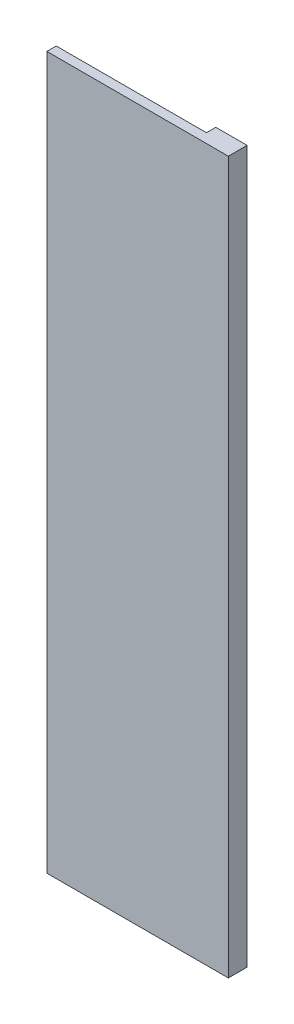
ISO-10303-21;
HEADER;
FILE_DESCRIPTION(('STEP AP214'),'2;1');
FILE_NAME('part.step','',(''),(''),'','','');
FILE_SCHEMA(('AUTOMOTIVE_DESIGN { 1 0 10303 214 1 1 1 1 }'));
ENDSEC;
DATA;
#1=APPLICATION_CONTEXT('core data for automotive mechanical design processes');
#2=APPLICATION_PROTOCOL_DEFINITION('international standard','automotive_design',2000,#1);
#3=PRODUCT_CONTEXT('',#1,'mechanical');
#4=PRODUCT('Part','Part','',(#3));
#5=PRODUCT_RELATED_PRODUCT_CATEGORY('part','',(#4));
#6=PRODUCT_DEFINITION_FORMATION('','',#4);
#7=PRODUCT_DEFINITION_CONTEXT('part definition',#1,'design');
#8=PRODUCT_DEFINITION('design','',#6,#7);
#9=PRODUCT_DEFINITION_SHAPE('','',#8);
#10=(LENGTH_UNIT() NAMED_UNIT(*) SI_UNIT(.MILLI.,.METRE.));
#11=(NAMED_UNIT(*) PLANE_ANGLE_UNIT() SI_UNIT($,.RADIAN.));
#12=(NAMED_UNIT(*) SI_UNIT($,.STERADIAN.) SOLID_ANGLE_UNIT());
#13=UNCERTAINTY_MEASURE_WITH_UNIT(LENGTH_MEASURE(1.E-05),#10,'distance_accuracy_value','');
#14=(GEOMETRIC_REPRESENTATION_CONTEXT(3) GLOBAL_UNCERTAINTY_ASSIGNED_CONTEXT((#13)) GLOBAL_UNIT_ASSIGNED_CONTEXT((#10,
#11,#12)) REPRESENTATION_CONTEXT('',''));
#15=CARTESIAN_POINT('',(0.,0.,0.));
#16=DIRECTION('',(0.,0.,1.));
#17=DIRECTION('',(1.,0.,0.));
#18=AXIS2_PLACEMENT_3D('',#15,#16,#17);
#19=CARTESIAN_POINT('',(48.,0.,-6.));
#20=DIRECTION('',(-1.,0.,0.));
#21=DIRECTION('',(0.,0.,1.));
#22=AXIS2_PLACEMENT_3D('',#19,#20,#21);
#23=PLANE('',#22);
#24=DIRECTION('',(0.,0.,-1.));
#25=VECTOR('',#24,1.);
#26=CARTESIAN_POINT('',(48.,10.,28.2842712474619));
#27=LINE('',#26,#25);
#28=CARTESIAN_POINT('',(48.,10.,0.));
#29=VERTEX_POINT('',#28);
#30=CARTESIAN_POINT('',(48.,10.,-6.));
#31=VERTEX_POINT('',#30);
#32=EDGE_CURVE('E49',#29,#31,#27,.T.);
#33=ORIENTED_EDGE('',*,*,#32,.F.);
#34=DIRECTION('',(0.,-1.,0.));
#35=VECTOR('',#34,1.);
#36=CARTESIAN_POINT('',(48.,0.,0.));
#37=LINE('',#36,#35);
#38=CARTESIAN_POINT('',(48.,435.,0.));
#39=VERTEX_POINT('',#38);
#40=EDGE_CURVE('E123',#39,#29,#37,.T.);
#41=ORIENTED_EDGE('',*,*,#40,.F.);
#42=DIRECTION('',(0.,0.,1.));
#43=VECTOR('',#42,1.);
#44=CARTESIAN_POINT('',(48.,435.,-6.));
#45=LINE('',#44,#43);
#46=CARTESIAN_POINT('',(48.,435.,-6.));
#47=VERTEX_POINT('',#46);
#48=EDGE_CURVE('E11',#47,#39,#45,.T.);
#49=ORIENTED_EDGE('',*,*,#48,.F.);
#50=DIRECTION('',(0.,-1.,0.));
#51=VECTOR('',#50,1.);
#52=CARTESIAN_POINT('',(48.,0.,-6.));
#53=LINE('',#52,#51);
#54=EDGE_CURVE('E127',#47,#31,#53,.T.);
#55=ORIENTED_EDGE('',*,*,#54,.T.);
#56=EDGE_LOOP('',(#33,#41,#49,#55));
#57=FACE_BOUND('',#56,.T.);
#58=ADVANCED_FACE('F33',(#57),#23,.T.);
#59=CARTESIAN_POINT('',(0.,435.,-6.));
#60=DIRECTION('',(0.,-1.,0.));
#61=DIRECTION('',(0.,0.,-1.));
#62=AXIS2_PLACEMENT_3D('',#59,#60,#61);
#63=PLANE('',#62);
#64=ORIENTED_EDGE('',*,*,#48,.T.);
#65=DIRECTION('',(-1.,0.,0.));
#66=VECTOR('',#65,1.);
#67=CARTESIAN_POINT('',(68.0000000000001,435.,0.));
#68=LINE('',#67,#66);
#69=CARTESIAN_POINT('',(-48.,435.,0.));
#70=VERTEX_POINT('',#69);
#71=EDGE_CURVE('E143',#39,#70,#68,.T.);
#72=ORIENTED_EDGE('',*,*,#71,.T.);
#73=DIRECTION('',(0.,0.,-1.));
#74=VECTOR('',#73,1.);
#75=CARTESIAN_POINT('',(-48.,435.,6.));
#76=LINE('',#75,#74);
#77=CARTESIAN_POINT('',(-48.,435.,6.));
#78=VERTEX_POINT('',#77);
#79=EDGE_CURVE('E126',#78,#70,#76,.T.);
#80=ORIENTED_EDGE('',*,*,#79,.F.);
#81=DIRECTION('',(-1.,0.,0.));
#82=VECTOR('',#81,1.);
#83=CARTESIAN_POINT('',(68.0000000000001,435.,6.));
#84=LINE('',#83,#82);
#85=CARTESIAN_POINT('',(68.0000000000001,435.,6.));
#86=VERTEX_POINT('',#85);
#87=EDGE_CURVE('E145',#86,#78,#84,.T.);
#88=ORIENTED_EDGE('',*,*,#87,.F.);
#89=DIRECTION('',(0.,0.,1.));
#90=VECTOR('',#89,1.);
#91=CARTESIAN_POINT('',(67.9999999999999,435.,-6.));
#92=LINE('',#91,#90);
#93=CARTESIAN_POINT('',(67.9999999999999,435.,-6.));
#94=VERTEX_POINT('',#93);
#95=EDGE_CURVE('E41',#94,#86,#92,.T.);
#96=ORIENTED_EDGE('',*,*,#95,.F.);
#97=DIRECTION('',(1.,0.,0.));
#98=VECTOR('',#97,1.);
#99=CARTESIAN_POINT('',(0.,435.,-6.));
#100=LINE('',#99,#98);
#101=EDGE_CURVE('E99',#47,#94,#100,.T.);
#102=ORIENTED_EDGE('',*,*,#101,.F.);
#103=EDGE_LOOP('',(#64,#72,#80,#88,#96,#102));
#104=FACE_BOUND('',#103,.T.);
#105=ADVANCED_FACE('F178',(#104),#63,.F.);
#106=CARTESIAN_POINT('',(68.0000000000001,0.,-6.));
#107=DIRECTION('',(-1.,0.,0.));
#108=DIRECTION('',(0.,-1.,0.));
#109=AXIS2_PLACEMENT_3D('',#106,#107,#108);
#110=PLANE('',#109);
#111=ORIENTED_EDGE('',*,*,#95,.T.);
#112=DIRECTION('',(0.,1.,0.));
#113=VECTOR('',#112,1.);
#114=CARTESIAN_POINT('',(68.0000000000001,-20.,6.));
#115=LINE('',#114,#113);
#116=CARTESIAN_POINT('',(68.0000000000001,-20.,6.));
#117=VERTEX_POINT('',#116);
#118=EDGE_CURVE('E108',#117,#86,#115,.T.);
#119=ORIENTED_EDGE('',*,*,#118,.F.);
#120=DIRECTION('',(0.,0.,1.));
#121=VECTOR('',#120,1.);
#122=CARTESIAN_POINT('',(68.0000000000001,-20.,-6.));
#123=LINE('',#122,#121);
#124=CARTESIAN_POINT('',(68.0000000000001,-20.,-6.));
#125=VERTEX_POINT('',#124);
#126=EDGE_CURVE('E105',#125,#117,#123,.T.);
#127=ORIENTED_EDGE('',*,*,#126,.F.);
#128=DIRECTION('',(0.,-1.,0.));
#129=VECTOR('',#128,1.);
#130=CARTESIAN_POINT('',(68.0000000000001,0.,-6.));
#131=LINE('',#130,#129);
#132=EDGE_CURVE('E90',#94,#125,#131,.T.);
#133=ORIENTED_EDGE('',*,*,#132,.F.);
#134=EDGE_LOOP('',(#111,#119,#127,#133));
#135=FACE_BOUND('',#134,.T.);
#136=ADVANCED_FACE('F106',(#135),#110,.F.);
#137=CARTESIAN_POINT('',(0.,-20.,-6.));
#138=DIRECTION('',(0.,-1.,0.));
#139=DIRECTION('',(1.,0.,0.));
#140=AXIS2_PLACEMENT_3D('',#137,#138,#139);
#141=PLANE('',#140);
#142=ORIENTED_EDGE('',*,*,#126,.T.);
#143=DIRECTION('',(1.,0.,0.));
#144=VECTOR('',#143,1.);
#145=CARTESIAN_POINT('',(68.0000000000001,-20.,6.));
#146=LINE('',#145,#144);
#147=CARTESIAN_POINT('',(-48.,-20.,6.));
#148=VERTEX_POINT('',#147);
#149=EDGE_CURVE('E151',#148,#117,#146,.T.);
#150=ORIENTED_EDGE('',*,*,#149,.F.);
#151=DIRECTION('',(0.,0.,1.));
#152=VECTOR('',#151,1.);
#153=CARTESIAN_POINT('',(-47.9999999999999,-20.,-6.));
#154=LINE('',#153,#152);
#155=CARTESIAN_POINT('',(-47.9999999999999,-20.,-6.));
#156=VERTEX_POINT('',#155);
#157=EDGE_CURVE('E112',#156,#148,#154,.T.);
#158=ORIENTED_EDGE('',*,*,#157,.F.);
#159=DIRECTION('',(1.,0.,0.));
#160=VECTOR('',#159,1.);
#161=CARTESIAN_POINT('',(0.,-20.,-6.));
#162=LINE('',#161,#160);
#163=EDGE_CURVE('E96',#156,#125,#162,.T.);
#164=ORIENTED_EDGE('',*,*,#163,.T.);
#165=EDGE_LOOP('',(#142,#150,#158,#164));
#166=FACE_BOUND('',#165,.T.);
#167=ADVANCED_FACE('F114',(#166),#141,.T.);
#168=CARTESIAN_POINT('',(-47.9999999999999,0.,-6.));
#169=DIRECTION('',(-1.,0.,0.));
#170=DIRECTION('',(0.,-1.,0.));
#171=AXIS2_PLACEMENT_3D('',#168,#169,#170);
#172=PLANE('',#171);
#173=ORIENTED_EDGE('',*,*,#157,.T.);
#174=DIRECTION('',(0.,-1.,0.));
#175=VECTOR('',#174,1.);
#176=CARTESIAN_POINT('',(-48.,-20.,6.));
#177=LINE('',#176,#175);
#178=EDGE_CURVE('E165',#78,#148,#177,.T.);
#179=ORIENTED_EDGE('',*,*,#178,.F.);
#180=ORIENTED_EDGE('',*,*,#79,.T.);
#181=DIRECTION('',(0.,-1.,0.));
#182=VECTOR('',#181,1.);
#183=CARTESIAN_POINT('',(-48.,-20.,0.));
#184=LINE('',#183,#182);
#185=CARTESIAN_POINT('',(-48.,0.,0.));
#186=VERTEX_POINT('',#185);
#187=EDGE_CURVE('E139',#70,#186,#184,.T.);
#188=ORIENTED_EDGE('',*,*,#187,.T.);
#189=DIRECTION('',(0.,0.,1.));
#190=VECTOR('',#189,1.);
#191=CARTESIAN_POINT('',(-47.9999999999999,0.,-6.));
#192=LINE('',#191,#190);
#193=CARTESIAN_POINT('',(-47.9999999999999,0.,-6.));
#194=VERTEX_POINT('',#193);
#195=EDGE_CURVE('E36',#194,#186,#192,.T.);
#196=ORIENTED_EDGE('',*,*,#195,.F.);
#197=DIRECTION('',(0.,-1.,0.));
#198=VECTOR('',#197,1.);
#199=CARTESIAN_POINT('',(-47.9999999999999,0.,-6.));
#200=LINE('',#199,#198);
#201=EDGE_CURVE('E116',#194,#156,#200,.T.);
#202=ORIENTED_EDGE('',*,*,#201,.T.);
#203=EDGE_LOOP('',(#173,#179,#180,#188,#196,#202));
#204=FACE_BOUND('',#203,.T.);
#205=ADVANCED_FACE('F140',(#204),#172,.T.);
#206=CARTESIAN_POINT('',(0.,0.,-6.));
#207=DIRECTION('',(0.,1.,0.));
#208=DIRECTION('',(0.,0.,1.));
#209=AXIS2_PLACEMENT_3D('',#206,#207,#208);
#210=PLANE('',#209);
#211=DIRECTION('',(0.,0.,-1.));
#212=VECTOR('',#211,1.);
#213=CARTESIAN_POINT('',(38.,0.,28.2842712474619));
#214=LINE('',#213,#212);
#215=CARTESIAN_POINT('',(38.,0.,-6.));
#216=VERTEX_POINT('',#215);
#217=CARTESIAN_POINT('',(38.,0.,0.));
#218=VERTEX_POINT('',#217);
#219=EDGE_CURVE('E158',#216,#218,#214,.F.);
#220=ORIENTED_EDGE('',*,*,#219,.F.);
#221=DIRECTION('',(-1.,0.,0.));
#222=VECTOR('',#221,1.);
#223=CARTESIAN_POINT('',(0.,0.,-6.));
#224=LINE('',#223,#222);
#225=EDGE_CURVE('E118',#216,#194,#224,.T.);
#226=ORIENTED_EDGE('',*,*,#225,.T.);
#227=ORIENTED_EDGE('',*,*,#195,.T.);
#228=DIRECTION('',(-1.,0.,0.));
#229=VECTOR('',#228,1.);
#230=CARTESIAN_POINT('',(0.,0.,0.));
#231=LINE('',#230,#229);
#232=EDGE_CURVE('E77',#218,#186,#231,.T.);
#233=ORIENTED_EDGE('',*,*,#232,.F.);
#234=EDGE_LOOP('',(#220,#226,#227,#233));
#235=FACE_BOUND('',#234,.T.);
#236=ADVANCED_FACE('F136',(#235),#210,.T.);
#237=CARTESIAN_POINT('',(0.,0.,-6.));
#238=DIRECTION('',(0.,0.,1.));
#239=DIRECTION('',(1.,0.,0.));
#240=AXIS2_PLACEMENT_3D('',#237,#238,#239);
#241=PLANE('',#240);
#242=ORIENTED_EDGE('',*,*,#225,.F.);
#243=CARTESIAN_POINT('',(48.,0.,-6.));
#244=DIRECTION('',(0.,0.,-1.));
#245=DIRECTION('',(-1.,0.,0.));
#246=AXIS2_PLACEMENT_3D('',#243,#244,#245);
#247=CIRCLE('',#246,10.);
#248=EDGE_CURVE('E153',#31,#216,#247,.T.);
#249=ORIENTED_EDGE('',*,*,#248,.F.);
#250=ORIENTED_EDGE('',*,*,#54,.F.);
#251=ORIENTED_EDGE('',*,*,#101,.T.);
#252=ORIENTED_EDGE('',*,*,#132,.T.);
#253=ORIENTED_EDGE('',*,*,#163,.F.);
#254=ORIENTED_EDGE('',*,*,#201,.F.);
#255=EDGE_LOOP('',(#242,#249,#250,#251,#252,#253,#254));
#256=FACE_BOUND('',#255,.T.);
#257=ADVANCED_FACE('F93',(#256),#241,.F.);
#258=CARTESIAN_POINT('',(0.,0.,0.));
#259=DIRECTION('',(0.,0.,1.));
#260=DIRECTION('',(1.,0.,0.));
#261=AXIS2_PLACEMENT_3D('',#258,#259,#260);
#262=PLANE('',#261);
#263=ORIENTED_EDGE('',*,*,#40,.T.);
#264=CARTESIAN_POINT('',(48.,0.,0.));
#265=DIRECTION('',(0.,0.,1.));
#266=DIRECTION('',(1.,0.,0.));
#267=AXIS2_PLACEMENT_3D('',#264,#265,#266);
#268=CIRCLE('',#267,10.);
#269=EDGE_CURVE('E156',#29,#218,#268,.F.);
#270=ORIENTED_EDGE('',*,*,#269,.T.);
#271=ORIENTED_EDGE('',*,*,#232,.T.);
#272=ORIENTED_EDGE('',*,*,#187,.F.);
#273=ORIENTED_EDGE('',*,*,#71,.F.);
#274=EDGE_LOOP('',(#263,#270,#271,#272,#273));
#275=FACE_BOUND('',#274,.T.);
#276=ADVANCED_FACE('F177',(#275),#262,.F.);
#277=CARTESIAN_POINT('',(0.,0.,6.));
#278=DIRECTION('',(0.,0.,1.));
#279=DIRECTION('',(1.,0.,0.));
#280=AXIS2_PLACEMENT_3D('',#277,#278,#279);
#281=PLANE('',#280);
#282=ORIENTED_EDGE('',*,*,#118,.T.);
#283=ORIENTED_EDGE('',*,*,#87,.T.);
#284=ORIENTED_EDGE('',*,*,#178,.T.);
#285=ORIENTED_EDGE('',*,*,#149,.T.);
#286=EDGE_LOOP('',(#282,#283,#284,#285));
#287=FACE_BOUND('',#286,.T.);
#288=ADVANCED_FACE('F167',(#287),#281,.T.);
#289=CARTESIAN_POINT('',(48.,0.,28.2842712474619));
#290=DIRECTION('',(0.,0.,-1.));
#291=DIRECTION('',(-1.,0.,0.));
#292=AXIS2_PLACEMENT_3D('',#289,#290,#291);
#293=CYLINDRICAL_SURFACE('',#292,10.);
#294=ORIENTED_EDGE('',*,*,#32,.T.);
#295=ORIENTED_EDGE('',*,*,#248,.T.);
#296=ORIENTED_EDGE('',*,*,#219,.T.);
#297=ORIENTED_EDGE('',*,*,#269,.F.);
#298=EDGE_LOOP('',(#294,#295,#296,#297));
#299=FACE_BOUND('',#298,.T.);
#300=ADVANCED_FACE('F176',(#299),#293,.F.);
#301=CLOSED_SHELL('',(#58,#105,#136,#167,#205,#236,#257,#276,#288,#300));
#302=MANIFOLD_SOLID_BREP('B2',#301);
#303=ADVANCED_BREP_SHAPE_REPRESENTATION('',(#18,#302),#14);
#304=SHAPE_DEFINITION_REPRESENTATION(#9,#303);
ENDSEC;
END-ISO-10303-21;
